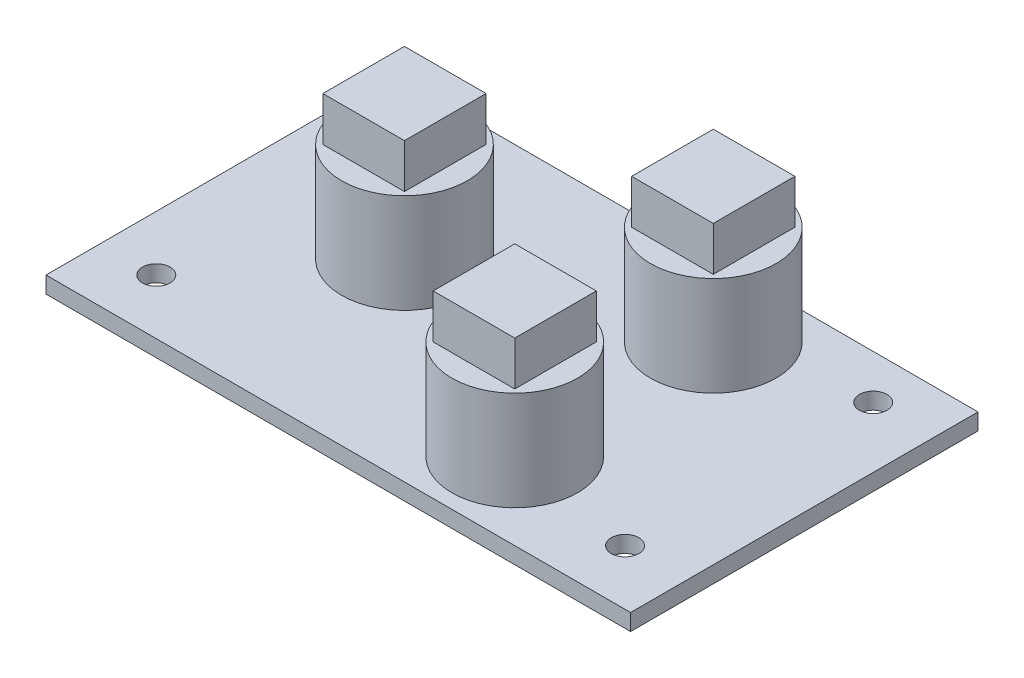
ISO-10303-21;
HEADER;
FILE_DESCRIPTION(('STEP AP214'),'2;1');
FILE_NAME('part.step','',(''),(''),'','','');
FILE_SCHEMA(('AUTOMOTIVE_DESIGN { 1 0 10303 214 1 1 1 1 }'));
ENDSEC;
DATA;
#1=APPLICATION_CONTEXT('core data for automotive mechanical design processes');
#2=APPLICATION_PROTOCOL_DEFINITION('international standard','automotive_design',2000,#1);
#3=PRODUCT_CONTEXT('',#1,'mechanical');
#4=PRODUCT('Part','Part','',(#3));
#5=PRODUCT_RELATED_PRODUCT_CATEGORY('part','',(#4));
#6=PRODUCT_DEFINITION_FORMATION('','',#4);
#7=PRODUCT_DEFINITION_CONTEXT('part definition',#1,'design');
#8=PRODUCT_DEFINITION('design','',#6,#7);
#9=PRODUCT_DEFINITION_SHAPE('','',#8);
#10=(LENGTH_UNIT() NAMED_UNIT(*) SI_UNIT(.MILLI.,.METRE.));
#11=(NAMED_UNIT(*) PLANE_ANGLE_UNIT() SI_UNIT($,.RADIAN.));
#12=(NAMED_UNIT(*) SI_UNIT($,.STERADIAN.) SOLID_ANGLE_UNIT());
#13=UNCERTAINTY_MEASURE_WITH_UNIT(LENGTH_MEASURE(1.E-05),#10,'distance_accuracy_value','');
#14=(GEOMETRIC_REPRESENTATION_CONTEXT(3) GLOBAL_UNCERTAINTY_ASSIGNED_CONTEXT((#13)) GLOBAL_UNIT_ASSIGNED_CONTEXT((#10,
#11,#12)) REPRESENTATION_CONTEXT('',''));
#15=CARTESIAN_POINT('',(0.,0.,0.));
#16=DIRECTION('',(0.,0.,1.));
#17=DIRECTION('',(1.,0.,0.));
#18=AXIS2_PLACEMENT_3D('',#15,#16,#17);
#19=CARTESIAN_POINT('',(9.00000000000001,10.5,8.75));
#20=DIRECTION('',(0.,1.,0.));
#21=DIRECTION('',(0.,0.,1.));
#22=AXIS2_PLACEMENT_3D('',#19,#20,#21);
#23=PLANE('',#22);
#24=CARTESIAN_POINT('',(9.00000000000001,10.5,8.75));
#25=DIRECTION('',(0.,1.,0.));
#26=DIRECTION('',(0.,0.,1.));
#27=AXIS2_PLACEMENT_3D('',#24,#25,#26);
#28=CIRCLE('',#27,5.7);
#29=CARTESIAN_POINT('',(9.00000000000001,10.5,14.45));
#30=VERTEX_POINT('',#29);
#31=EDGE_CURVE('E242',#30,#30,#28,.T.);
#32=ORIENTED_EDGE('',*,*,#31,.T.);
#33=EDGE_LOOP('',(#32));
#34=FACE_BOUND('',#33,.T.);
#35=DIRECTION('',(1.,0.,0.));
#36=VECTOR('',#35,1.);
#37=CARTESIAN_POINT('',(12.7,10.5,12.45));
#38=LINE('',#37,#36);
#39=CARTESIAN_POINT('',(5.3,10.5,12.45));
#40=VERTEX_POINT('',#39);
#41=CARTESIAN_POINT('',(12.7,10.5,12.45));
#42=VERTEX_POINT('',#41);
#43=EDGE_CURVE('E619',#40,#42,#38,.T.);
#44=ORIENTED_EDGE('',*,*,#43,.F.);
#45=DIRECTION('',(0.,0.,1.));
#46=VECTOR('',#45,1.);
#47=CARTESIAN_POINT('',(5.3,10.5,12.45));
#48=LINE('',#47,#46);
#49=CARTESIAN_POINT('',(5.3,10.5,5.05));
#50=VERTEX_POINT('',#49);
#51=EDGE_CURVE('E173',#50,#40,#48,.T.);
#52=ORIENTED_EDGE('',*,*,#51,.F.);
#53=DIRECTION('',(-1.,0.,0.));
#54=VECTOR('',#53,1.);
#55=CARTESIAN_POINT('',(12.7,10.5,5.04999999999999));
#56=LINE('',#55,#54);
#57=CARTESIAN_POINT('',(12.7,10.5,5.04999999999999));
#58=VERTEX_POINT('',#57);
#59=EDGE_CURVE('E169',#58,#50,#56,.T.);
#60=ORIENTED_EDGE('',*,*,#59,.F.);
#61=DIRECTION('',(0.,0.,-1.));
#62=VECTOR('',#61,1.);
#63=CARTESIAN_POINT('',(12.7,10.5,12.45));
#64=LINE('',#63,#62);
#65=EDGE_CURVE('E616',#42,#58,#64,.T.);
#66=ORIENTED_EDGE('',*,*,#65,.F.);
#67=EDGE_LOOP('',(#44,#52,#60,#66));
#68=FACE_BOUND('',#67,.T.);
#69=ADVANCED_FACE('F36',(#34,#68),#23,.T.);
#70=CARTESIAN_POINT('',(8.99999999999999,10.5,-9.25));
#71=DIRECTION('',(0.,1.,0.));
#72=DIRECTION('',(0.,0.,1.));
#73=AXIS2_PLACEMENT_3D('',#70,#71,#72);
#74=PLANE('',#73);
#75=CARTESIAN_POINT('',(8.99999999999999,10.5,-9.25));
#76=DIRECTION('',(0.,1.,0.));
#77=DIRECTION('',(0.,0.,1.));
#78=AXIS2_PLACEMENT_3D('',#75,#76,#77);
#79=CIRCLE('',#78,5.7);
#80=CARTESIAN_POINT('',(8.99999999999999,10.5,-3.55));
#81=VERTEX_POINT('',#80);
#82=EDGE_CURVE('E236',#81,#81,#79,.T.);
#83=ORIENTED_EDGE('',*,*,#82,.T.);
#84=EDGE_LOOP('',(#83));
#85=FACE_BOUND('',#84,.T.);
#86=DIRECTION('',(1.,0.,0.));
#87=VECTOR('',#86,1.);
#88=CARTESIAN_POINT('',(12.7,10.5,-5.55));
#89=LINE('',#88,#87);
#90=CARTESIAN_POINT('',(5.3,10.5,-5.55));
#91=VERTEX_POINT('',#90);
#92=CARTESIAN_POINT('',(12.7,10.5,-5.55));
#93=VERTEX_POINT('',#92);
#94=EDGE_CURVE('E178',#91,#93,#89,.T.);
#95=ORIENTED_EDGE('',*,*,#94,.F.);
#96=DIRECTION('',(0.,0.,1.));
#97=VECTOR('',#96,1.);
#98=CARTESIAN_POINT('',(5.3,10.5,-5.55));
#99=LINE('',#98,#97);
#100=CARTESIAN_POINT('',(5.3,10.5,-12.95));
#101=VERTEX_POINT('',#100);
#102=EDGE_CURVE('E175',#101,#91,#99,.T.);
#103=ORIENTED_EDGE('',*,*,#102,.F.);
#104=DIRECTION('',(-1.,0.,0.));
#105=VECTOR('',#104,1.);
#106=CARTESIAN_POINT('',(12.7,10.5,-12.95));
#107=LINE('',#106,#105);
#108=CARTESIAN_POINT('',(12.7,10.5,-12.95));
#109=VERTEX_POINT('',#108);
#110=EDGE_CURVE('E187',#109,#101,#107,.T.);
#111=ORIENTED_EDGE('',*,*,#110,.F.);
#112=DIRECTION('',(0.,0.,-1.));
#113=VECTOR('',#112,1.);
#114=CARTESIAN_POINT('',(12.7,10.5,-5.55));
#115=LINE('',#114,#113);
#116=EDGE_CURVE('E195',#93,#109,#115,.T.);
#117=ORIENTED_EDGE('',*,*,#116,.F.);
#118=EDGE_LOOP('',(#95,#103,#111,#117));
#119=FACE_BOUND('',#118,.T.);
#120=ADVANCED_FACE('F330',(#85,#119),#74,.T.);
#121=CARTESIAN_POINT('',(-11.5,10.5,-1.75));
#122=DIRECTION('',(0.,1.,0.));
#123=DIRECTION('',(0.,0.,1.));
#124=AXIS2_PLACEMENT_3D('',#121,#122,#123);
#125=PLANE('',#124);
#126=CARTESIAN_POINT('',(-11.5,10.5,-1.75));
#127=DIRECTION('',(0.,1.,0.));
#128=DIRECTION('',(0.,0.,1.));
#129=AXIS2_PLACEMENT_3D('',#126,#127,#128);
#130=CIRCLE('',#129,5.7);
#131=CARTESIAN_POINT('',(-11.5,10.5,3.95));
#132=VERTEX_POINT('',#131);
#133=EDGE_CURVE('E248',#132,#132,#130,.T.);
#134=ORIENTED_EDGE('',*,*,#133,.T.);
#135=EDGE_LOOP('',(#134));
#136=FACE_BOUND('',#135,.T.);
#137=DIRECTION('',(1.,0.,0.));
#138=VECTOR('',#137,1.);
#139=CARTESIAN_POINT('',(-7.80000000000001,10.5,1.95));
#140=LINE('',#139,#138);
#141=CARTESIAN_POINT('',(-15.2,10.5,1.95));
#142=VERTEX_POINT('',#141);
#143=CARTESIAN_POINT('',(-7.80000000000001,10.5,1.95));
#144=VERTEX_POINT('',#143);
#145=EDGE_CURVE('E220',#142,#144,#140,.T.);
#146=ORIENTED_EDGE('',*,*,#145,.F.);
#147=DIRECTION('',(0.,0.,1.));
#148=VECTOR('',#147,1.);
#149=CARTESIAN_POINT('',(-15.2,10.5,1.95));
#150=LINE('',#149,#148);
#151=CARTESIAN_POINT('',(-15.2,10.5,-5.45));
#152=VERTEX_POINT('',#151);
#153=EDGE_CURVE('E206',#152,#142,#150,.T.);
#154=ORIENTED_EDGE('',*,*,#153,.F.);
#155=DIRECTION('',(-1.,0.,0.));
#156=VECTOR('',#155,1.);
#157=CARTESIAN_POINT('',(-7.80000000000001,10.5,-5.45));
#158=LINE('',#157,#156);
#159=CARTESIAN_POINT('',(-7.80000000000001,10.5,-5.45));
#160=VERTEX_POINT('',#159);
#161=EDGE_CURVE('E211',#160,#152,#158,.T.);
#162=ORIENTED_EDGE('',*,*,#161,.F.);
#163=DIRECTION('',(0.,0.,-1.));
#164=VECTOR('',#163,1.);
#165=CARTESIAN_POINT('',(-7.80000000000001,10.5,1.95));
#166=LINE('',#165,#164);
#167=EDGE_CURVE('E222',#144,#160,#166,.T.);
#168=ORIENTED_EDGE('',*,*,#167,.F.);
#169=EDGE_LOOP('',(#146,#154,#162,#168));
#170=FACE_BOUND('',#169,.T.);
#171=ADVANCED_FACE('F336',(#136,#170),#125,.T.);
#172=CARTESIAN_POINT('',(0.,1.5,0.));
#173=DIRECTION('',(0.,1.,0.));
#174=DIRECTION('',(0.,0.,1.));
#175=AXIS2_PLACEMENT_3D('',#172,#173,#174);
#176=PLANE('',#175);
#177=CARTESIAN_POINT('',(9.00000000000001,1.5,8.75));
#178=DIRECTION('',(0.,1.,0.));
#179=DIRECTION('',(0.,0.,1.));
#180=AXIS2_PLACEMENT_3D('',#177,#178,#179);
#181=CIRCLE('',#180,5.7);
#182=CARTESIAN_POINT('',(9.00000000000001,1.5,14.45));
#183=VERTEX_POINT('',#182);
#184=EDGE_CURVE('E239',#183,#183,#181,.T.);
#185=ORIENTED_EDGE('',*,*,#184,.F.);
#186=EDGE_LOOP('',(#185));
#187=FACE_BOUND('',#186,.T.);
#188=DIRECTION('',(0.,0.,1.));
#189=VECTOR('',#188,1.);
#190=CARTESIAN_POINT('',(-26.5,1.5,15.75));
#191=LINE('',#190,#189);
#192=CARTESIAN_POINT('',(-26.5,1.5,-15.75));
#193=VERTEX_POINT('',#192);
#194=CARTESIAN_POINT('',(-26.5,1.5,15.75));
#195=VERTEX_POINT('',#194);
#196=EDGE_CURVE('E278',#193,#195,#191,.T.);
#197=ORIENTED_EDGE('',*,*,#196,.T.);
#198=DIRECTION('',(1.,0.,0.));
#199=VECTOR('',#198,1.);
#200=CARTESIAN_POINT('',(26.5,1.5,15.75));
#201=LINE('',#200,#199);
#202=CARTESIAN_POINT('',(26.5,1.5,15.75));
#203=VERTEX_POINT('',#202);
#204=EDGE_CURVE('E281',#195,#203,#201,.T.);
#205=ORIENTED_EDGE('',*,*,#204,.T.);
#206=DIRECTION('',(0.,0.,-1.));
#207=VECTOR('',#206,1.);
#208=CARTESIAN_POINT('',(26.5,1.5,15.75));
#209=LINE('',#208,#207);
#210=CARTESIAN_POINT('',(26.5,1.5,-15.75));
#211=VERTEX_POINT('',#210);
#212=EDGE_CURVE('E284',#203,#211,#209,.T.);
#213=ORIENTED_EDGE('',*,*,#212,.T.);
#214=DIRECTION('',(-1.,0.,0.));
#215=VECTOR('',#214,1.);
#216=CARTESIAN_POINT('',(26.5,1.5,-15.75));
#217=LINE('',#216,#215);
#218=EDGE_CURVE('E286',#211,#193,#217,.T.);
#219=ORIENTED_EDGE('',*,*,#218,.T.);
#220=EDGE_LOOP('',(#197,#205,#213,#219));
#221=FACE_BOUND('',#220,.T.);
#222=CARTESIAN_POINT('',(-21.5,1.5,-11.75));
#223=DIRECTION('',(0.,1.,0.));
#224=DIRECTION('',(0.,0.,1.));
#225=AXIS2_PLACEMENT_3D('',#222,#223,#224);
#226=CIRCLE('',#225,1.25);
#227=CARTESIAN_POINT('',(-21.5,1.5,-10.5));
#228=VERTEX_POINT('',#227);
#229=EDGE_CURVE('E269',#228,#228,#226,.T.);
#230=ORIENTED_EDGE('',*,*,#229,.F.);
#231=EDGE_LOOP('',(#230));
#232=FACE_BOUND('',#231,.T.);
#233=CARTESIAN_POINT('',(21.,1.5,-11.75));
#234=DIRECTION('',(0.,1.,0.));
#235=DIRECTION('',(0.,0.,1.));
#236=AXIS2_PLACEMENT_3D('',#233,#234,#235);
#237=CIRCLE('',#236,1.25);
#238=CARTESIAN_POINT('',(21.,1.5,-10.5));
#239=VERTEX_POINT('',#238);
#240=EDGE_CURVE('E263',#239,#239,#237,.T.);
#241=ORIENTED_EDGE('',*,*,#240,.F.);
#242=EDGE_LOOP('',(#241));
#243=FACE_BOUND('',#242,.T.);
#244=CARTESIAN_POINT('',(21.,1.5,10.75));
#245=DIRECTION('',(0.,1.,0.));
#246=DIRECTION('',(0.,0.,1.));
#247=AXIS2_PLACEMENT_3D('',#244,#245,#246);
#248=CIRCLE('',#247,1.25);
#249=CARTESIAN_POINT('',(21.,1.5,12.));
#250=VERTEX_POINT('',#249);
#251=EDGE_CURVE('E257',#250,#250,#248,.T.);
#252=ORIENTED_EDGE('',*,*,#251,.F.);
#253=EDGE_LOOP('',(#252));
#254=FACE_BOUND('',#253,.T.);
#255=CARTESIAN_POINT('',(-21.5,1.5,10.75));
#256=DIRECTION('',(0.,1.,0.));
#257=DIRECTION('',(0.,0.,1.));
#258=AXIS2_PLACEMENT_3D('',#255,#256,#257);
#259=CIRCLE('',#258,1.25);
#260=CARTESIAN_POINT('',(-21.5,1.5,12.));
#261=VERTEX_POINT('',#260);
#262=EDGE_CURVE('E251',#261,#261,#259,.T.);
#263=ORIENTED_EDGE('',*,*,#262,.F.);
#264=EDGE_LOOP('',(#263));
#265=FACE_BOUND('',#264,.T.);
#266=CARTESIAN_POINT('',(-11.5,1.5,-1.75));
#267=DIRECTION('',(0.,1.,0.));
#268=DIRECTION('',(0.,0.,1.));
#269=AXIS2_PLACEMENT_3D('',#266,#267,#268);
#270=CIRCLE('',#269,5.7);
#271=CARTESIAN_POINT('',(-11.5,1.5,3.95));
#272=VERTEX_POINT('',#271);
#273=EDGE_CURVE('E245',#272,#272,#270,.T.);
#274=ORIENTED_EDGE('',*,*,#273,.F.);
#275=EDGE_LOOP('',(#274));
#276=FACE_BOUND('',#275,.T.);
#277=CARTESIAN_POINT('',(8.99999999999999,1.5,-9.25));
#278=DIRECTION('',(0.,1.,0.));
#279=DIRECTION('',(0.,0.,1.));
#280=AXIS2_PLACEMENT_3D('',#277,#278,#279);
#281=CIRCLE('',#280,5.7);
#282=CARTESIAN_POINT('',(8.99999999999999,1.5,-3.55));
#283=VERTEX_POINT('',#282);
#284=EDGE_CURVE('E235',#283,#283,#281,.T.);
#285=ORIENTED_EDGE('',*,*,#284,.F.);
#286=EDGE_LOOP('',(#285));
#287=FACE_BOUND('',#286,.T.);
#288=ADVANCED_FACE('F320',(#187,#221,#232,#243,#254,#265,#276,#287),#176,.T.);
#289=CARTESIAN_POINT('',(-26.5,1.5,15.75));
#290=DIRECTION('',(1.,0.,0.));
#291=DIRECTION('',(0.,0.,-1.));
#292=AXIS2_PLACEMENT_3D('',#289,#290,#291);
#293=PLANE('',#292);
#294=DIRECTION('',(0.,0.,1.));
#295=VECTOR('',#294,1.);
#296=CARTESIAN_POINT('',(-26.5,0.,15.75));
#297=LINE('',#296,#295);
#298=CARTESIAN_POINT('',(-26.5,0.,-15.75));
#299=VERTEX_POINT('',#298);
#300=CARTESIAN_POINT('',(-26.5,0.,15.75));
#301=VERTEX_POINT('',#300);
#302=EDGE_CURVE('E275',#299,#301,#297,.T.);
#303=ORIENTED_EDGE('',*,*,#302,.T.);
#304=DIRECTION('',(0.,-1.,0.));
#305=VECTOR('',#304,1.);
#306=CARTESIAN_POINT('',(-26.5,1.5,15.75));
#307=LINE('',#306,#305);
#308=EDGE_CURVE('E11',#195,#301,#307,.T.);
#309=ORIENTED_EDGE('',*,*,#308,.F.);
#310=ORIENTED_EDGE('',*,*,#196,.F.);
#311=DIRECTION('',(0.,-1.,0.));
#312=VECTOR('',#311,1.);
#313=CARTESIAN_POINT('',(-26.5,1.5,-15.75));
#314=LINE('',#313,#312);
#315=EDGE_CURVE('E288',#193,#299,#314,.T.);
#316=ORIENTED_EDGE('',*,*,#315,.T.);
#317=EDGE_LOOP('',(#303,#309,#310,#316));
#318=FACE_BOUND('',#317,.T.);
#319=ADVANCED_FACE('F38',(#318),#293,.F.);
#320=CARTESIAN_POINT('',(26.5,1.5,15.75));
#321=DIRECTION('',(0.,0.,-1.));
#322=DIRECTION('',(-1.,0.,0.));
#323=AXIS2_PLACEMENT_3D('',#320,#321,#322);
#324=PLANE('',#323);
#325=DIRECTION('',(1.,0.,0.));
#326=VECTOR('',#325,1.);
#327=CARTESIAN_POINT('',(26.5,0.,15.75));
#328=LINE('',#327,#326);
#329=CARTESIAN_POINT('',(26.5,0.,15.75));
#330=VERTEX_POINT('',#329);
#331=EDGE_CURVE('E291',#301,#330,#328,.T.);
#332=ORIENTED_EDGE('',*,*,#331,.T.);
#333=DIRECTION('',(0.,-1.,0.));
#334=VECTOR('',#333,1.);
#335=CARTESIAN_POINT('',(26.5,1.5,15.75));
#336=LINE('',#335,#334);
#337=EDGE_CURVE('E44',#203,#330,#336,.T.);
#338=ORIENTED_EDGE('',*,*,#337,.F.);
#339=ORIENTED_EDGE('',*,*,#204,.F.);
#340=ORIENTED_EDGE('',*,*,#308,.T.);
#341=EDGE_LOOP('',(#332,#338,#339,#340));
#342=FACE_BOUND('',#341,.T.);
#343=ADVANCED_FACE('F322',(#342),#324,.F.);
#344=CARTESIAN_POINT('',(26.5,1.5,15.75));
#345=DIRECTION('',(-1.,0.,0.));
#346=DIRECTION('',(0.,0.,1.));
#347=AXIS2_PLACEMENT_3D('',#344,#345,#346);
#348=PLANE('',#347);
#349=DIRECTION('',(0.,0.,-1.));
#350=VECTOR('',#349,1.);
#351=CARTESIAN_POINT('',(26.5,0.,15.75));
#352=LINE('',#351,#350);
#353=CARTESIAN_POINT('',(26.5,0.,-15.75));
#354=VERTEX_POINT('',#353);
#355=EDGE_CURVE('E293',#330,#354,#352,.T.);
#356=ORIENTED_EDGE('',*,*,#355,.T.);
#357=DIRECTION('',(0.,-1.,0.));
#358=VECTOR('',#357,1.);
#359=CARTESIAN_POINT('',(26.5,1.5,-15.75));
#360=LINE('',#359,#358);
#361=EDGE_CURVE('E298',#211,#354,#360,.T.);
#362=ORIENTED_EDGE('',*,*,#361,.F.);
#363=ORIENTED_EDGE('',*,*,#212,.F.);
#364=ORIENTED_EDGE('',*,*,#337,.T.);
#365=EDGE_LOOP('',(#356,#362,#363,#364));
#366=FACE_BOUND('',#365,.T.);
#367=ADVANCED_FACE('F305',(#366),#348,.F.);
#368=CARTESIAN_POINT('',(26.5,1.5,-15.75));
#369=DIRECTION('',(0.,0.,1.));
#370=DIRECTION('',(1.,0.,0.));
#371=AXIS2_PLACEMENT_3D('',#368,#369,#370);
#372=PLANE('',#371);
#373=DIRECTION('',(-1.,0.,0.));
#374=VECTOR('',#373,1.);
#375=CARTESIAN_POINT('',(26.5,0.,-15.75));
#376=LINE('',#375,#374);
#377=EDGE_CURVE('E282',#354,#299,#376,.T.);
#378=ORIENTED_EDGE('',*,*,#377,.T.);
#379=ORIENTED_EDGE('',*,*,#315,.F.);
#380=ORIENTED_EDGE('',*,*,#218,.F.);
#381=ORIENTED_EDGE('',*,*,#361,.T.);
#382=EDGE_LOOP('',(#378,#379,#380,#381));
#383=FACE_BOUND('',#382,.T.);
#384=ADVANCED_FACE('F314',(#383),#372,.F.);
#385=CARTESIAN_POINT('',(0.,0.,0.));
#386=DIRECTION('',(0.,1.,0.));
#387=DIRECTION('',(0.,0.,1.));
#388=AXIS2_PLACEMENT_3D('',#385,#386,#387);
#389=PLANE('',#388);
#390=CARTESIAN_POINT('',(-21.5,0.,10.75));
#391=DIRECTION('',(0.,1.,0.));
#392=DIRECTION('',(0.,0.,1.));
#393=AXIS2_PLACEMENT_3D('',#390,#391,#392);
#394=CIRCLE('',#393,1.25);
#395=CARTESIAN_POINT('',(-21.5,0.,12.));
#396=VERTEX_POINT('',#395);
#397=EDGE_CURVE('E254',#396,#396,#394,.T.);
#398=ORIENTED_EDGE('',*,*,#397,.T.);
#399=EDGE_LOOP('',(#398));
#400=FACE_BOUND('',#399,.T.);
#401=CARTESIAN_POINT('',(21.,0.,10.75));
#402=DIRECTION('',(0.,1.,0.));
#403=DIRECTION('',(0.,0.,1.));
#404=AXIS2_PLACEMENT_3D('',#401,#402,#403);
#405=CIRCLE('',#404,1.25);
#406=CARTESIAN_POINT('',(21.,0.,12.));
#407=VERTEX_POINT('',#406);
#408=EDGE_CURVE('E260',#407,#407,#405,.T.);
#409=ORIENTED_EDGE('',*,*,#408,.T.);
#410=EDGE_LOOP('',(#409));
#411=FACE_BOUND('',#410,.T.);
#412=CARTESIAN_POINT('',(21.,0.,-11.75));
#413=DIRECTION('',(0.,1.,0.));
#414=DIRECTION('',(0.,0.,1.));
#415=AXIS2_PLACEMENT_3D('',#412,#413,#414);
#416=CIRCLE('',#415,1.25);
#417=CARTESIAN_POINT('',(21.,0.,-10.5));
#418=VERTEX_POINT('',#417);
#419=EDGE_CURVE('E266',#418,#418,#416,.T.);
#420=ORIENTED_EDGE('',*,*,#419,.T.);
#421=EDGE_LOOP('',(#420));
#422=FACE_BOUND('',#421,.T.);
#423=CARTESIAN_POINT('',(-21.5,0.,-11.75));
#424=DIRECTION('',(0.,1.,0.));
#425=DIRECTION('',(0.,0.,1.));
#426=AXIS2_PLACEMENT_3D('',#423,#424,#425);
#427=CIRCLE('',#426,1.25);
#428=CARTESIAN_POINT('',(-21.5,0.,-10.5));
#429=VERTEX_POINT('',#428);
#430=EDGE_CURVE('E272',#429,#429,#427,.T.);
#431=ORIENTED_EDGE('',*,*,#430,.T.);
#432=EDGE_LOOP('',(#431));
#433=FACE_BOUND('',#432,.T.);
#434=ORIENTED_EDGE('',*,*,#302,.F.);
#435=ORIENTED_EDGE('',*,*,#377,.F.);
#436=ORIENTED_EDGE('',*,*,#355,.F.);
#437=ORIENTED_EDGE('',*,*,#331,.F.);
#438=EDGE_LOOP('',(#434,#435,#436,#437));
#439=FACE_BOUND('',#438,.T.);
#440=ADVANCED_FACE('F311',(#400,#411,#422,#433,#439),#389,.F.);
#441=CARTESIAN_POINT('',(-21.5,0.,-11.75));
#442=DIRECTION('',(0.,1.,0.));
#443=DIRECTION('',(0.,0.,1.));
#444=AXIS2_PLACEMENT_3D('',#441,#442,#443);
#445=CYLINDRICAL_SURFACE('',#444,1.25);
#446=ORIENTED_EDGE('',*,*,#430,.F.);
#447=EDGE_LOOP('',(#446));
#448=FACE_BOUND('',#447,.T.);
#449=ORIENTED_EDGE('',*,*,#229,.T.);
#450=EDGE_LOOP('',(#449));
#451=FACE_BOUND('',#450,.T.);
#452=ADVANCED_FACE('F365',(#448,#451),#445,.F.);
#453=CARTESIAN_POINT('',(21.,0.,-11.75));
#454=DIRECTION('',(0.,1.,0.));
#455=DIRECTION('',(0.,0.,1.));
#456=AXIS2_PLACEMENT_3D('',#453,#454,#455);
#457=CYLINDRICAL_SURFACE('',#456,1.25);
#458=ORIENTED_EDGE('',*,*,#419,.F.);
#459=EDGE_LOOP('',(#458));
#460=FACE_BOUND('',#459,.T.);
#461=ORIENTED_EDGE('',*,*,#240,.T.);
#462=EDGE_LOOP('',(#461));
#463=FACE_BOUND('',#462,.T.);
#464=ADVANCED_FACE('F361',(#460,#463),#457,.F.);
#465=CARTESIAN_POINT('',(21.,0.,10.75));
#466=DIRECTION('',(0.,1.,0.));
#467=DIRECTION('',(0.,0.,1.));
#468=AXIS2_PLACEMENT_3D('',#465,#466,#467);
#469=CYLINDRICAL_SURFACE('',#468,1.25);
#470=ORIENTED_EDGE('',*,*,#408,.F.);
#471=EDGE_LOOP('',(#470));
#472=FACE_BOUND('',#471,.T.);
#473=ORIENTED_EDGE('',*,*,#251,.T.);
#474=EDGE_LOOP('',(#473));
#475=FACE_BOUND('',#474,.T.);
#476=ADVANCED_FACE('F357',(#472,#475),#469,.F.);
#477=CARTESIAN_POINT('',(-21.5,0.,10.75));
#478=DIRECTION('',(0.,1.,0.));
#479=DIRECTION('',(0.,0.,1.));
#480=AXIS2_PLACEMENT_3D('',#477,#478,#479);
#481=CYLINDRICAL_SURFACE('',#480,1.25);
#482=ORIENTED_EDGE('',*,*,#397,.F.);
#483=EDGE_LOOP('',(#482));
#484=FACE_BOUND('',#483,.T.);
#485=ORIENTED_EDGE('',*,*,#262,.T.);
#486=EDGE_LOOP('',(#485));
#487=FACE_BOUND('',#486,.T.);
#488=ADVANCED_FACE('F353',(#484,#487),#481,.F.);
#489=CARTESIAN_POINT('',(-11.5,10.5,-1.75));
#490=DIRECTION('',(0.,-1.,0.));
#491=DIRECTION('',(0.,0.,-1.));
#492=AXIS2_PLACEMENT_3D('',#489,#490,#491);
#493=CYLINDRICAL_SURFACE('',#492,5.7);
#494=ORIENTED_EDGE('',*,*,#133,.F.);
#495=EDGE_LOOP('',(#494));
#496=FACE_BOUND('',#495,.T.);
#497=ORIENTED_EDGE('',*,*,#273,.T.);
#498=EDGE_LOOP('',(#497));
#499=FACE_BOUND('',#498,.T.);
#500=ADVANCED_FACE('F346',(#496,#499),#493,.T.);
#501=CARTESIAN_POINT('',(9.00000000000001,10.5,8.75));
#502=DIRECTION('',(0.,-1.,0.));
#503=DIRECTION('',(0.,0.,-1.));
#504=AXIS2_PLACEMENT_3D('',#501,#502,#503);
#505=CYLINDRICAL_SURFACE('',#504,5.7);
#506=ORIENTED_EDGE('',*,*,#31,.F.);
#507=EDGE_LOOP('',(#506));
#508=FACE_BOUND('',#507,.T.);
#509=ORIENTED_EDGE('',*,*,#184,.T.);
#510=EDGE_LOOP('',(#509));
#511=FACE_BOUND('',#510,.T.);
#512=ADVANCED_FACE('F343',(#508,#511),#505,.T.);
#513=CARTESIAN_POINT('',(8.99999999999999,10.5,-9.25));
#514=DIRECTION('',(0.,-1.,0.));
#515=DIRECTION('',(0.,0.,-1.));
#516=AXIS2_PLACEMENT_3D('',#513,#514,#515);
#517=CYLINDRICAL_SURFACE('',#516,5.7);
#518=ORIENTED_EDGE('',*,*,#82,.F.);
#519=EDGE_LOOP('',(#518));
#520=FACE_BOUND('',#519,.T.);
#521=ORIENTED_EDGE('',*,*,#284,.T.);
#522=EDGE_LOOP('',(#521));
#523=FACE_BOUND('',#522,.T.);
#524=ADVANCED_FACE('F342',(#520,#523),#517,.T.);
#525=CARTESIAN_POINT('',(-15.2,14.5,1.95));
#526=DIRECTION('',(1.,0.,0.));
#527=DIRECTION('',(0.,0.,-1.));
#528=AXIS2_PLACEMENT_3D('',#525,#526,#527);
#529=PLANE('',#528);
#530=ORIENTED_EDGE('',*,*,#153,.T.);
#531=DIRECTION('',(0.,-1.,0.));
#532=VECTOR('',#531,1.);
#533=CARTESIAN_POINT('',(-15.2,14.5,1.95));
#534=LINE('',#533,#532);
#535=CARTESIAN_POINT('',(-15.2,14.5,1.95));
#536=VERTEX_POINT('',#535);
#537=EDGE_CURVE('E233',#536,#142,#534,.T.);
#538=ORIENTED_EDGE('',*,*,#537,.F.);
#539=DIRECTION('',(0.,0.,1.));
#540=VECTOR('',#539,1.);
#541=CARTESIAN_POINT('',(-15.2,14.5,1.95));
#542=LINE('',#541,#540);
#543=CARTESIAN_POINT('',(-15.2,14.5,-5.45));
#544=VERTEX_POINT('',#543);
#545=EDGE_CURVE('E207',#544,#536,#542,.T.);
#546=ORIENTED_EDGE('',*,*,#545,.F.);
#547=DIRECTION('',(0.,-1.,0.));
#548=VECTOR('',#547,1.);
#549=CARTESIAN_POINT('',(-15.2,14.5,-5.45));
#550=LINE('',#549,#548);
#551=EDGE_CURVE('E217',#544,#152,#550,.T.);
#552=ORIENTED_EDGE('',*,*,#551,.T.);
#553=EDGE_LOOP('',(#530,#538,#546,#552));
#554=FACE_BOUND('',#553,.T.);
#555=ADVANCED_FACE('F416',(#554),#529,.F.);
#556=CARTESIAN_POINT('',(-7.80000000000001,14.5,1.95));
#557=DIRECTION('',(0.,0.,-1.));
#558=DIRECTION('',(-1.,0.,0.));
#559=AXIS2_PLACEMENT_3D('',#556,#557,#558);
#560=PLANE('',#559);
#561=ORIENTED_EDGE('',*,*,#145,.T.);
#562=DIRECTION('',(0.,-1.,0.));
#563=VECTOR('',#562,1.);
#564=CARTESIAN_POINT('',(-7.80000000000001,14.5,1.95));
#565=LINE('',#564,#563);
#566=CARTESIAN_POINT('',(-7.80000000000001,14.5,1.95));
#567=VERTEX_POINT('',#566);
#568=EDGE_CURVE('E230',#567,#144,#565,.T.);
#569=ORIENTED_EDGE('',*,*,#568,.F.);
#570=DIRECTION('',(1.,0.,0.));
#571=VECTOR('',#570,1.);
#572=CARTESIAN_POINT('',(-7.80000000000001,14.5,1.95));
#573=LINE('',#572,#571);
#574=EDGE_CURVE('E210',#536,#567,#573,.T.);
#575=ORIENTED_EDGE('',*,*,#574,.F.);
#576=ORIENTED_EDGE('',*,*,#537,.T.);
#577=EDGE_LOOP('',(#561,#569,#575,#576));
#578=FACE_BOUND('',#577,.T.);
#579=ADVANCED_FACE('F423',(#578),#560,.F.);
#580=CARTESIAN_POINT('',(-7.80000000000001,14.5,1.95));
#581=DIRECTION('',(-1.,0.,0.));
#582=DIRECTION('',(0.,0.,1.));
#583=AXIS2_PLACEMENT_3D('',#580,#581,#582);
#584=PLANE('',#583);
#585=ORIENTED_EDGE('',*,*,#167,.T.);
#586=DIRECTION('',(0.,-1.,0.));
#587=VECTOR('',#586,1.);
#588=CARTESIAN_POINT('',(-7.80000000000001,14.5,-5.45));
#589=LINE('',#588,#587);
#590=CARTESIAN_POINT('',(-7.80000000000001,14.5,-5.45));
#591=VERTEX_POINT('',#590);
#592=EDGE_CURVE('E228',#591,#160,#589,.T.);
#593=ORIENTED_EDGE('',*,*,#592,.F.);
#594=DIRECTION('',(0.,0.,-1.));
#595=VECTOR('',#594,1.);
#596=CARTESIAN_POINT('',(-7.80000000000001,14.5,1.95));
#597=LINE('',#596,#595);
#598=EDGE_CURVE('E213',#567,#591,#597,.T.);
#599=ORIENTED_EDGE('',*,*,#598,.F.);
#600=ORIENTED_EDGE('',*,*,#568,.T.);
#601=EDGE_LOOP('',(#585,#593,#599,#600));
#602=FACE_BOUND('',#601,.T.);
#603=ADVANCED_FACE('F432',(#602),#584,.F.);
#604=CARTESIAN_POINT('',(-7.80000000000001,14.5,-5.45));
#605=DIRECTION('',(0.,0.,1.));
#606=DIRECTION('',(1.,0.,0.));
#607=AXIS2_PLACEMENT_3D('',#604,#605,#606);
#608=PLANE('',#607);
#609=ORIENTED_EDGE('',*,*,#161,.T.);
#610=ORIENTED_EDGE('',*,*,#551,.F.);
#611=DIRECTION('',(-1.,0.,0.));
#612=VECTOR('',#611,1.);
#613=CARTESIAN_POINT('',(-7.80000000000001,14.5,-5.45));
#614=LINE('',#613,#612);
#615=EDGE_CURVE('E215',#591,#544,#614,.T.);
#616=ORIENTED_EDGE('',*,*,#615,.F.);
#617=ORIENTED_EDGE('',*,*,#592,.T.);
#618=EDGE_LOOP('',(#609,#610,#616,#617));
#619=FACE_BOUND('',#618,.T.);
#620=ADVANCED_FACE('F440',(#619),#608,.F.);
#621=CARTESIAN_POINT('',(0.,14.5,0.));
#622=DIRECTION('',(0.,1.,0.));
#623=DIRECTION('',(0.,0.,1.));
#624=AXIS2_PLACEMENT_3D('',#621,#622,#623);
#625=PLANE('',#624);
#626=ORIENTED_EDGE('',*,*,#545,.T.);
#627=ORIENTED_EDGE('',*,*,#574,.T.);
#628=ORIENTED_EDGE('',*,*,#598,.T.);
#629=ORIENTED_EDGE('',*,*,#615,.T.);
#630=EDGE_LOOP('',(#626,#627,#628,#629));
#631=FACE_BOUND('',#630,.T.);
#632=ADVANCED_FACE('F448',(#631),#625,.T.);
#633=CARTESIAN_POINT('',(5.3,14.5,-5.55));
#634=DIRECTION('',(1.,0.,0.));
#635=DIRECTION('',(0.,0.,-1.));
#636=AXIS2_PLACEMENT_3D('',#633,#634,#635);
#637=PLANE('',#636);
#638=ORIENTED_EDGE('',*,*,#102,.T.);
#639=DIRECTION('',(0.,-1.,0.));
#640=VECTOR('',#639,1.);
#641=CARTESIAN_POINT('',(5.3,14.5,-5.55));
#642=LINE('',#641,#640);
#643=CARTESIAN_POINT('',(5.3,14.5,-5.55));
#644=VERTEX_POINT('',#643);
#645=EDGE_CURVE('E204',#644,#91,#642,.T.);
#646=ORIENTED_EDGE('',*,*,#645,.F.);
#647=DIRECTION('',(0.,0.,1.));
#648=VECTOR('',#647,1.);
#649=CARTESIAN_POINT('',(5.3,14.5,-5.55));
#650=LINE('',#649,#648);
#651=CARTESIAN_POINT('',(5.3,14.5,-12.95));
#652=VERTEX_POINT('',#651);
#653=EDGE_CURVE('E183',#652,#644,#650,.T.);
#654=ORIENTED_EDGE('',*,*,#653,.F.);
#655=DIRECTION('',(0.,-1.,0.));
#656=VECTOR('',#655,1.);
#657=CARTESIAN_POINT('',(5.3,14.5,-12.95));
#658=LINE('',#657,#656);
#659=EDGE_CURVE('E192',#652,#101,#658,.T.);
#660=ORIENTED_EDGE('',*,*,#659,.T.);
#661=EDGE_LOOP('',(#638,#646,#654,#660));
#662=FACE_BOUND('',#661,.T.);
#663=ADVANCED_FACE('F456',(#662),#637,.F.);
#664=CARTESIAN_POINT('',(12.7,14.5,-5.55));
#665=DIRECTION('',(0.,0.,-1.));
#666=DIRECTION('',(-1.,0.,0.));
#667=AXIS2_PLACEMENT_3D('',#664,#665,#666);
#668=PLANE('',#667);
#669=ORIENTED_EDGE('',*,*,#94,.T.);
#670=DIRECTION('',(0.,-1.,0.));
#671=VECTOR('',#670,1.);
#672=CARTESIAN_POINT('',(12.7,14.5,-5.55));
#673=LINE('',#672,#671);
#674=CARTESIAN_POINT('',(12.7,14.5,-5.55));
#675=VERTEX_POINT('',#674);
#676=EDGE_CURVE('E201',#675,#93,#673,.T.);
#677=ORIENTED_EDGE('',*,*,#676,.F.);
#678=DIRECTION('',(1.,0.,0.));
#679=VECTOR('',#678,1.);
#680=CARTESIAN_POINT('',(12.7,14.5,-5.55));
#681=LINE('',#680,#679);
#682=EDGE_CURVE('E186',#644,#675,#681,.T.);
#683=ORIENTED_EDGE('',*,*,#682,.F.);
#684=ORIENTED_EDGE('',*,*,#645,.T.);
#685=EDGE_LOOP('',(#669,#677,#683,#684));
#686=FACE_BOUND('',#685,.T.);
#687=ADVANCED_FACE('F464',(#686),#668,.F.);
#688=CARTESIAN_POINT('',(12.7,14.5,-5.55));
#689=DIRECTION('',(-1.,0.,0.));
#690=DIRECTION('',(0.,0.,1.));
#691=AXIS2_PLACEMENT_3D('',#688,#689,#690);
#692=PLANE('',#691);
#693=ORIENTED_EDGE('',*,*,#116,.T.);
#694=DIRECTION('',(0.,-1.,0.));
#695=VECTOR('',#694,1.);
#696=CARTESIAN_POINT('',(12.7,14.5,-12.95));
#697=LINE('',#696,#695);
#698=CARTESIAN_POINT('',(12.7,14.5,-12.95));
#699=VERTEX_POINT('',#698);
#700=EDGE_CURVE('E59',#699,#109,#697,.T.);
#701=ORIENTED_EDGE('',*,*,#700,.F.);
#702=DIRECTION('',(0.,0.,-1.));
#703=VECTOR('',#702,1.);
#704=CARTESIAN_POINT('',(12.7,14.5,-5.55));
#705=LINE('',#704,#703);
#706=EDGE_CURVE('E189',#675,#699,#705,.T.);
#707=ORIENTED_EDGE('',*,*,#706,.F.);
#708=ORIENTED_EDGE('',*,*,#676,.T.);
#709=EDGE_LOOP('',(#693,#701,#707,#708));
#710=FACE_BOUND('',#709,.T.);
#711=ADVANCED_FACE('F472',(#710),#692,.F.);
#712=CARTESIAN_POINT('',(12.7,14.5,-12.95));
#713=DIRECTION('',(0.,0.,1.));
#714=DIRECTION('',(1.,0.,0.));
#715=AXIS2_PLACEMENT_3D('',#712,#713,#714);
#716=PLANE('',#715);
#717=ORIENTED_EDGE('',*,*,#110,.T.);
#718=ORIENTED_EDGE('',*,*,#659,.F.);
#719=DIRECTION('',(-1.,0.,0.));
#720=VECTOR('',#719,1.);
#721=CARTESIAN_POINT('',(12.7,14.5,-12.95));
#722=LINE('',#721,#720);
#723=EDGE_CURVE('E191',#699,#652,#722,.T.);
#724=ORIENTED_EDGE('',*,*,#723,.F.);
#725=ORIENTED_EDGE('',*,*,#700,.T.);
#726=EDGE_LOOP('',(#717,#718,#724,#725));
#727=FACE_BOUND('',#726,.T.);
#728=ADVANCED_FACE('F480',(#727),#716,.F.);
#729=CARTESIAN_POINT('',(0.,14.5,0.));
#730=DIRECTION('',(0.,1.,0.));
#731=DIRECTION('',(0.,0.,1.));
#732=AXIS2_PLACEMENT_3D('',#729,#730,#731);
#733=PLANE('',#732);
#734=ORIENTED_EDGE('',*,*,#653,.T.);
#735=ORIENTED_EDGE('',*,*,#682,.T.);
#736=ORIENTED_EDGE('',*,*,#706,.T.);
#737=ORIENTED_EDGE('',*,*,#723,.T.);
#738=EDGE_LOOP('',(#734,#735,#736,#737));
#739=FACE_BOUND('',#738,.T.);
#740=ADVANCED_FACE('F488',(#739),#733,.T.);
#741=CARTESIAN_POINT('',(5.3,14.5,12.45));
#742=DIRECTION('',(1.,0.,0.));
#743=DIRECTION('',(0.,0.,-1.));
#744=AXIS2_PLACEMENT_3D('',#741,#742,#743);
#745=PLANE('',#744);
#746=ORIENTED_EDGE('',*,*,#51,.T.);
#747=DIRECTION('',(0.,-1.,0.));
#748=VECTOR('',#747,1.);
#749=CARTESIAN_POINT('',(5.3,14.5,12.45));
#750=LINE('',#749,#748);
#751=CARTESIAN_POINT('',(5.3,14.5,12.45));
#752=VERTEX_POINT('',#751);
#753=EDGE_CURVE('E154',#752,#40,#750,.T.);
#754=ORIENTED_EDGE('',*,*,#753,.F.);
#755=DIRECTION('',(0.,0.,1.));
#756=VECTOR('',#755,1.);
#757=CARTESIAN_POINT('',(5.3,14.5,12.45));
#758=LINE('',#757,#756);
#759=CARTESIAN_POINT('',(5.3,14.5,5.05));
#760=VERTEX_POINT('',#759);
#761=EDGE_CURVE('E161',#760,#752,#758,.T.);
#762=ORIENTED_EDGE('',*,*,#761,.F.);
#763=DIRECTION('',(0.,-1.,0.));
#764=VECTOR('',#763,1.);
#765=CARTESIAN_POINT('',(5.3,14.5,5.05));
#766=LINE('',#765,#764);
#767=EDGE_CURVE('E614',#760,#50,#766,.T.);
#768=ORIENTED_EDGE('',*,*,#767,.T.);
#769=EDGE_LOOP('',(#746,#754,#762,#768));
#770=FACE_BOUND('',#769,.T.);
#771=ADVANCED_FACE('F171',(#770),#745,.F.);
#772=CARTESIAN_POINT('',(12.7,14.5,12.45));
#773=DIRECTION('',(0.,0.,-1.));
#774=DIRECTION('',(-1.,0.,0.));
#775=AXIS2_PLACEMENT_3D('',#772,#773,#774);
#776=PLANE('',#775);
#777=ORIENTED_EDGE('',*,*,#43,.T.);
#778=DIRECTION('',(0.,-1.,0.));
#779=VECTOR('',#778,1.);
#780=CARTESIAN_POINT('',(12.7,14.5,12.45));
#781=LINE('',#780,#779);
#782=CARTESIAN_POINT('',(12.7,14.5,12.45));
#783=VERTEX_POINT('',#782);
#784=EDGE_CURVE('E157',#783,#42,#781,.T.);
#785=ORIENTED_EDGE('',*,*,#784,.F.);
#786=DIRECTION('',(1.,0.,0.));
#787=VECTOR('',#786,1.);
#788=CARTESIAN_POINT('',(12.7,14.5,12.45));
#789=LINE('',#788,#787);
#790=EDGE_CURVE('E150',#752,#783,#789,.T.);
#791=ORIENTED_EDGE('',*,*,#790,.F.);
#792=ORIENTED_EDGE('',*,*,#753,.T.);
#793=EDGE_LOOP('',(#777,#785,#791,#792));
#794=FACE_BOUND('',#793,.T.);
#795=ADVANCED_FACE('F152',(#794),#776,.F.);
#796=CARTESIAN_POINT('',(12.7,14.5,12.45));
#797=DIRECTION('',(-1.,0.,0.));
#798=DIRECTION('',(0.,0.,1.));
#799=AXIS2_PLACEMENT_3D('',#796,#797,#798);
#800=PLANE('',#799);
#801=ORIENTED_EDGE('',*,*,#65,.T.);
#802=DIRECTION('',(0.,-1.,0.));
#803=VECTOR('',#802,1.);
#804=CARTESIAN_POINT('',(12.7,14.5,5.04999999999999));
#805=LINE('',#804,#803);
#806=CARTESIAN_POINT('',(12.7,14.5,5.04999999999999));
#807=VERTEX_POINT('',#806);
#808=EDGE_CURVE('E51',#807,#58,#805,.T.);
#809=ORIENTED_EDGE('',*,*,#808,.F.);
#810=DIRECTION('',(0.,0.,-1.));
#811=VECTOR('',#810,1.);
#812=CARTESIAN_POINT('',(12.7,14.5,12.45));
#813=LINE('',#812,#811);
#814=EDGE_CURVE('E160',#783,#807,#813,.T.);
#815=ORIENTED_EDGE('',*,*,#814,.F.);
#816=ORIENTED_EDGE('',*,*,#784,.T.);
#817=EDGE_LOOP('',(#801,#809,#815,#816));
#818=FACE_BOUND('',#817,.T.);
#819=ADVANCED_FACE('F508',(#818),#800,.F.);
#820=CARTESIAN_POINT('',(12.7,14.5,5.04999999999999));
#821=DIRECTION('',(0.,0.,1.));
#822=DIRECTION('',(1.,0.,0.));
#823=AXIS2_PLACEMENT_3D('',#820,#821,#822);
#824=PLANE('',#823);
#825=ORIENTED_EDGE('',*,*,#59,.T.);
#826=ORIENTED_EDGE('',*,*,#767,.F.);
#827=DIRECTION('',(-1.,0.,0.));
#828=VECTOR('',#827,1.);
#829=CARTESIAN_POINT('',(12.7,14.5,5.04999999999999));
#830=LINE('',#829,#828);
#831=EDGE_CURVE('E165',#807,#760,#830,.T.);
#832=ORIENTED_EDGE('',*,*,#831,.F.);
#833=ORIENTED_EDGE('',*,*,#808,.T.);
#834=EDGE_LOOP('',(#825,#826,#832,#833));
#835=FACE_BOUND('',#834,.T.);
#836=ADVANCED_FACE('F515',(#835),#824,.F.);
#837=CARTESIAN_POINT('',(0.,14.5,0.));
#838=DIRECTION('',(0.,1.,0.));
#839=DIRECTION('',(0.,0.,1.));
#840=AXIS2_PLACEMENT_3D('',#837,#838,#839);
#841=PLANE('',#840);
#842=ORIENTED_EDGE('',*,*,#761,.T.);
#843=ORIENTED_EDGE('',*,*,#790,.T.);
#844=ORIENTED_EDGE('',*,*,#814,.T.);
#845=ORIENTED_EDGE('',*,*,#831,.T.);
#846=EDGE_LOOP('',(#842,#843,#844,#845));
#847=FACE_BOUND('',#846,.T.);
#848=ADVANCED_FACE('F164',(#847),#841,.T.);
#849=CLOSED_SHELL('',(#69,#120,#171,#288,#319,#343,#367,#384,#440,#452,#464,#476,#488,#500,#512,
#524,#555,#579,#603,#620,#632,#663,#687,#711,#728,#740,#771,#795,#819,#836,#848));
#850=MANIFOLD_SOLID_BREP('B2',#849);
#851=ADVANCED_BREP_SHAPE_REPRESENTATION('',(#18,#850),#14);
#852=SHAPE_DEFINITION_REPRESENTATION(#9,#851);
ENDSEC;
END-ISO-10303-21;
